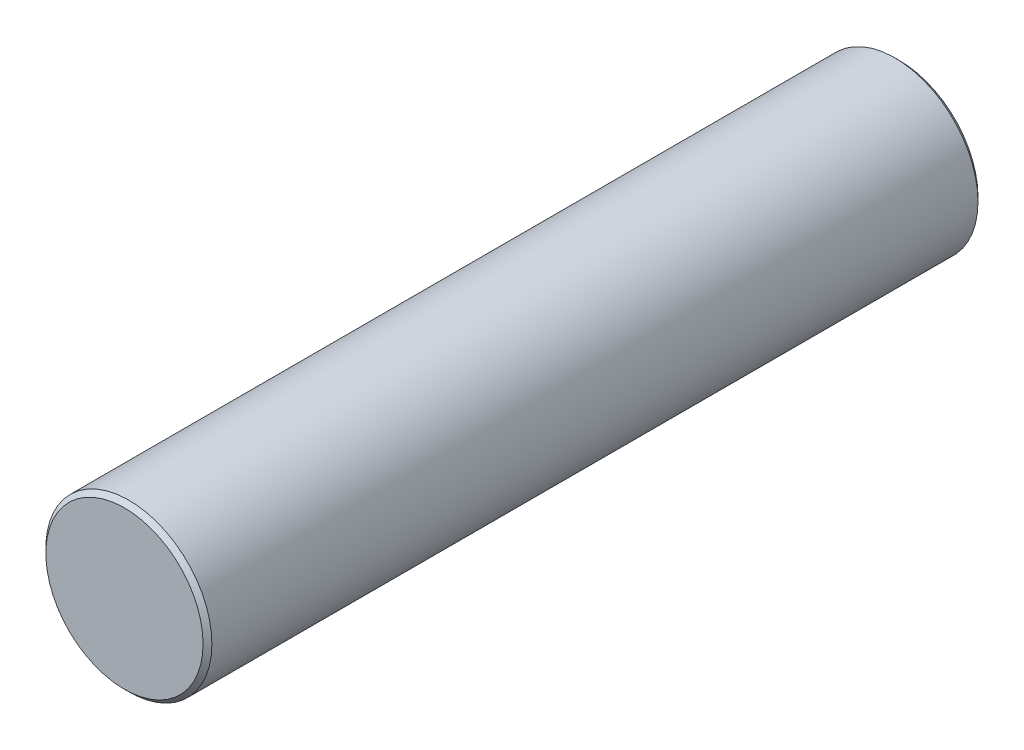
ISO-10303-21;
HEADER;
FILE_DESCRIPTION(('STEP AP214'),'2;1');
FILE_NAME('part.step','',(''),(''),'','','');
FILE_SCHEMA(('AUTOMOTIVE_DESIGN { 1 0 10303 214 1 1 1 1 }'));
ENDSEC;
DATA;
#1=APPLICATION_CONTEXT('core data for automotive mechanical design processes');
#2=APPLICATION_PROTOCOL_DEFINITION('international standard','automotive_design',2000,#1);
#3=PRODUCT_CONTEXT('',#1,'mechanical');
#4=PRODUCT('Part','Part','',(#3));
#5=PRODUCT_RELATED_PRODUCT_CATEGORY('part','',(#4));
#6=PRODUCT_DEFINITION_FORMATION('','',#4);
#7=PRODUCT_DEFINITION_CONTEXT('part definition',#1,'design');
#8=PRODUCT_DEFINITION('design','',#6,#7);
#9=PRODUCT_DEFINITION_SHAPE('','',#8);
#10=(LENGTH_UNIT() NAMED_UNIT(*) SI_UNIT(.MILLI.,.METRE.));
#11=(NAMED_UNIT(*) PLANE_ANGLE_UNIT() SI_UNIT($,.RADIAN.));
#12=(NAMED_UNIT(*) SI_UNIT($,.STERADIAN.) SOLID_ANGLE_UNIT());
#13=UNCERTAINTY_MEASURE_WITH_UNIT(LENGTH_MEASURE(1.E-05),#10,'distance_accuracy_value','');
#14=(GEOMETRIC_REPRESENTATION_CONTEXT(3) GLOBAL_UNCERTAINTY_ASSIGNED_CONTEXT((#13)) GLOBAL_UNIT_ASSIGNED_CONTEXT((#10,
#11,#12)) REPRESENTATION_CONTEXT('',''));
#15=CARTESIAN_POINT('',(0.,0.,0.));
#16=DIRECTION('',(0.,0.,1.));
#17=DIRECTION('',(1.,0.,0.));
#18=AXIS2_PLACEMENT_3D('',#15,#16,#17);
#19=CARTESIAN_POINT('',(0.,0.,-22.225));
#20=DIRECTION('',(0.,0.,1.));
#21=DIRECTION('',(1.,0.,0.));
#22=AXIS2_PLACEMENT_3D('',#19,#20,#21);
#23=CYLINDRICAL_SURFACE('',#22,2.38125);
#24=CARTESIAN_POINT('',(0.,0.,-22.098));
#25=DIRECTION('',(0.,0.,1.));
#26=DIRECTION('',(1.,0.,0.));
#27=AXIS2_PLACEMENT_3D('',#24,#25,#26);
#28=CIRCLE('',#27,2.38125);
#29=CARTESIAN_POINT('',(2.38125,0.,-22.098));
#30=VERTEX_POINT('',#29);
#31=EDGE_CURVE('E45',#30,#30,#28,.T.);
#32=ORIENTED_EDGE('',*,*,#31,.T.);
#33=EDGE_LOOP('',(#32));
#34=FACE_BOUND('',#33,.T.);
#35=CARTESIAN_POINT('',(0.,0.,-0.126999999999999));
#36=DIRECTION('',(0.,0.,1.));
#37=DIRECTION('',(1.,0.,0.));
#38=AXIS2_PLACEMENT_3D('',#35,#36,#37);
#39=CIRCLE('',#38,2.38125);
#40=CARTESIAN_POINT('',(2.38125,0.,-0.126999999999999));
#41=VERTEX_POINT('',#40);
#42=EDGE_CURVE('E49',#41,#41,#39,.F.);
#43=ORIENTED_EDGE('',*,*,#42,.T.);
#44=EDGE_LOOP('',(#43));
#45=FACE_BOUND('',#44,.T.);
#46=ADVANCED_FACE('F34',(#34,#45),#23,.T.);
#47=CARTESIAN_POINT('',(0.,0.,-22.225));
#48=DIRECTION('',(0.,0.,1.));
#49=DIRECTION('',(1.,0.,0.));
#50=AXIS2_PLACEMENT_3D('',#47,#48,#49);
#51=PLANE('',#50);
#52=CARTESIAN_POINT('',(0.,0.,-22.225));
#53=DIRECTION('',(0.,0.,1.));
#54=DIRECTION('',(1.,0.,0.));
#55=AXIS2_PLACEMENT_3D('',#52,#53,#54);
#56=CIRCLE('',#55,2.25425000000001);
#57=CARTESIAN_POINT('',(2.25425000000001,0.,-22.225));
#58=VERTEX_POINT('',#57);
#59=EDGE_CURVE('E41',#58,#58,#56,.F.);
#60=ORIENTED_EDGE('',*,*,#59,.T.);
#61=EDGE_LOOP('',(#60));
#62=FACE_BOUND('',#61,.T.);
#63=ADVANCED_FACE('F65',(#62),#51,.F.);
#64=CARTESIAN_POINT('',(0.,0.,0.));
#65=DIRECTION('',(0.,0.,1.));
#66=DIRECTION('',(1.,0.,0.));
#67=AXIS2_PLACEMENT_3D('',#64,#65,#66);
#68=PLANE('',#67);
#69=CARTESIAN_POINT('',(0.,0.,0.));
#70=DIRECTION('',(0.,0.,1.));
#71=DIRECTION('',(1.,0.,0.));
#72=AXIS2_PLACEMENT_3D('',#69,#70,#71);
#73=CIRCLE('',#72,2.25425);
#74=CARTESIAN_POINT('',(2.25425000000001,0.,0.));
#75=VERTEX_POINT('',#74);
#76=EDGE_CURVE('E10',#75,#75,#73,.T.);
#77=ORIENTED_EDGE('',*,*,#76,.T.);
#78=EDGE_LOOP('',(#77));
#79=FACE_BOUND('',#78,.T.);
#80=ADVANCED_FACE('F62',(#79),#68,.T.);
#81=CARTESIAN_POINT('',(0.,0.,-22.098));
#82=DIRECTION('',(0.,0.,1.));
#83=DIRECTION('',(1.,0.,0.));
#84=AXIS2_PLACEMENT_3D('',#81,#82,#83);
#85=CONICAL_SURFACE('',#84,2.38125,0.785398163397448);
#86=ORIENTED_EDGE('',*,*,#59,.F.);
#87=EDGE_LOOP('',(#86));
#88=FACE_BOUND('',#87,.T.);
#89=ORIENTED_EDGE('',*,*,#31,.F.);
#90=EDGE_LOOP('',(#89));
#91=FACE_BOUND('',#90,.T.);
#92=ADVANCED_FACE('F58',(#88,#91),#85,.T.);
#93=CARTESIAN_POINT('',(0.,0.,0.));
#94=DIRECTION('',(0.,0.,-1.));
#95=DIRECTION('',(-1.,0.,0.));
#96=AXIS2_PLACEMENT_3D('',#93,#94,#95);
#97=CONICAL_SURFACE('',#96,2.25425,0.785398163397442);
#98=ORIENTED_EDGE('',*,*,#42,.F.);
#99=EDGE_LOOP('',(#98));
#100=FACE_BOUND('',#99,.T.);
#101=ORIENTED_EDGE('',*,*,#76,.F.);
#102=EDGE_LOOP('',(#101));
#103=FACE_BOUND('',#102,.T.);
#104=ADVANCED_FACE('F36',(#100,#103),#97,.T.);
#105=CLOSED_SHELL('',(#46,#63,#80,#92,#104));
#106=MANIFOLD_SOLID_BREP('B2',#105);
#107=ADVANCED_BREP_SHAPE_REPRESENTATION('',(#18,#106),#14);
#108=SHAPE_DEFINITION_REPRESENTATION(#9,#107);
ENDSEC;
END-ISO-10303-21;
